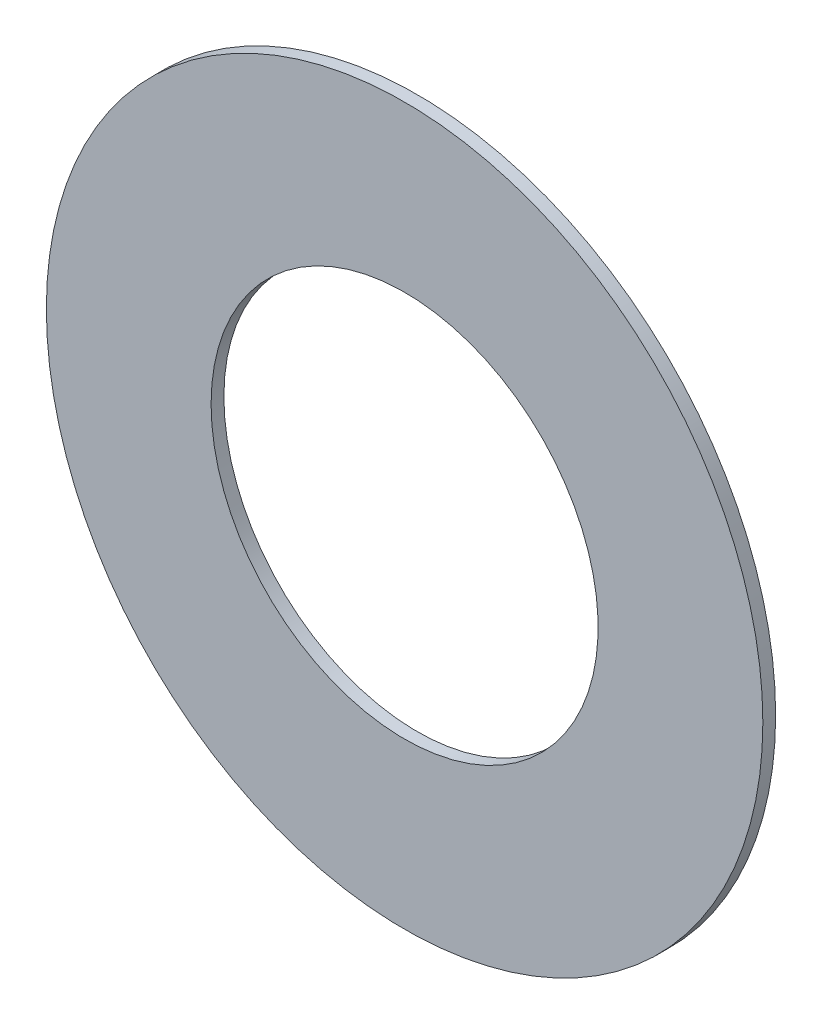
ISO-10303-21;
HEADER;
FILE_DESCRIPTION(('STEP AP214'),'2;1');
FILE_NAME('part.step','',(''),(''),'','','');
FILE_SCHEMA(('AUTOMOTIVE_DESIGN { 1 0 10303 214 1 1 1 1 }'));
ENDSEC;
DATA;
#1=APPLICATION_CONTEXT('core data for automotive mechanical design processes');
#2=APPLICATION_PROTOCOL_DEFINITION('international standard','automotive_design',2000,#1);
#3=PRODUCT_CONTEXT('',#1,'mechanical');
#4=PRODUCT('Part','Part','',(#3));
#5=PRODUCT_RELATED_PRODUCT_CATEGORY('part','',(#4));
#6=PRODUCT_DEFINITION_FORMATION('','',#4);
#7=PRODUCT_DEFINITION_CONTEXT('part definition',#1,'design');
#8=PRODUCT_DEFINITION('design','',#6,#7);
#9=PRODUCT_DEFINITION_SHAPE('','',#8);
#10=(LENGTH_UNIT() NAMED_UNIT(*) SI_UNIT(.MILLI.,.METRE.));
#11=(NAMED_UNIT(*) PLANE_ANGLE_UNIT() SI_UNIT($,.RADIAN.));
#12=(NAMED_UNIT(*) SI_UNIT($,.STERADIAN.) SOLID_ANGLE_UNIT());
#13=UNCERTAINTY_MEASURE_WITH_UNIT(LENGTH_MEASURE(1.E-05),#10,'distance_accuracy_value','');
#14=(GEOMETRIC_REPRESENTATION_CONTEXT(3) GLOBAL_UNCERTAINTY_ASSIGNED_CONTEXT((#13)) GLOBAL_UNIT_ASSIGNED_CONTEXT((#10,
#11,#12)) REPRESENTATION_CONTEXT('',''));
#15=CARTESIAN_POINT('',(0.,0.,0.));
#16=DIRECTION('',(0.,0.,1.));
#17=DIRECTION('',(1.,0.,0.));
#18=AXIS2_PLACEMENT_3D('',#15,#16,#17);
#19=CARTESIAN_POINT('',(0.,0.,0.));
#20=DIRECTION('',(0.,0.,1.));
#21=DIRECTION('',(1.,0.,0.));
#22=AXIS2_PLACEMENT_3D('',#19,#20,#21);
#23=PLANE('',#22);
#24=CARTESIAN_POINT('',(0.,0.,0.));
#25=DIRECTION('',(0.,0.,-1.));
#26=DIRECTION('',(-1.,0.,0.));
#27=AXIS2_PLACEMENT_3D('',#24,#25,#26);
#28=CIRCLE('',#27,7.6835);
#29=CARTESIAN_POINT('',(-7.6835,0.,0.));
#30=VERTEX_POINT('',#29);
#31=EDGE_CURVE('E26',#30,#30,#28,.F.);
#32=ORIENTED_EDGE('',*,*,#31,.T.);
#33=EDGE_LOOP('',(#32));
#34=FACE_BOUND('',#33,.T.);
#35=CARTESIAN_POINT('',(0.,0.,0.));
#36=DIRECTION('',(0.,0.,-1.));
#37=DIRECTION('',(-1.,0.,0.));
#38=AXIS2_PLACEMENT_3D('',#35,#36,#37);
#39=CIRCLE('',#38,14.224);
#40=CARTESIAN_POINT('',(-14.224,0.,0.));
#41=VERTEX_POINT('',#40);
#42=EDGE_CURVE('E17',#41,#41,#39,.F.);
#43=ORIENTED_EDGE('',*,*,#42,.F.);
#44=EDGE_LOOP('',(#43));
#45=FACE_BOUND('',#44,.T.);
#46=ADVANCED_FACE('F14',(#34,#45),#23,.F.);
#47=CARTESIAN_POINT('',(0.,0.,0.508));
#48=DIRECTION('',(0.,0.,-1.));
#49=DIRECTION('',(-1.,0.,0.));
#50=AXIS2_PLACEMENT_3D('',#47,#48,#49);
#51=CYLINDRICAL_SURFACE('',#50,14.224);
#52=ORIENTED_EDGE('',*,*,#42,.T.);
#53=EDGE_LOOP('',(#52));
#54=FACE_BOUND('',#53,.T.);
#55=CARTESIAN_POINT('',(0.,0.,0.508));
#56=DIRECTION('',(0.,0.,-1.));
#57=DIRECTION('',(-1.,0.,0.));
#58=AXIS2_PLACEMENT_3D('',#55,#56,#57);
#59=CIRCLE('',#58,14.224);
#60=CARTESIAN_POINT('',(-14.224,0.,0.508));
#61=VERTEX_POINT('',#60);
#62=EDGE_CURVE('E21',#61,#61,#59,.F.);
#63=ORIENTED_EDGE('',*,*,#62,.F.);
#64=EDGE_LOOP('',(#63));
#65=FACE_BOUND('',#64,.T.);
#66=ADVANCED_FACE('F34',(#54,#65),#51,.T.);
#67=CARTESIAN_POINT('',(0.,0.,0.508));
#68=DIRECTION('',(0.,0.,-1.));
#69=DIRECTION('',(-1.,0.,0.));
#70=AXIS2_PLACEMENT_3D('',#67,#68,#69);
#71=CYLINDRICAL_SURFACE('',#70,7.6835);
#72=CARTESIAN_POINT('',(0.,0.,0.508));
#73=DIRECTION('',(0.,0.,-1.));
#74=DIRECTION('',(-1.,0.,0.));
#75=AXIS2_PLACEMENT_3D('',#72,#73,#74);
#76=CIRCLE('',#75,7.6835);
#77=CARTESIAN_POINT('',(-7.6835,0.,0.508));
#78=VERTEX_POINT('',#77);
#79=EDGE_CURVE('E10',#78,#78,#76,.T.);
#80=ORIENTED_EDGE('',*,*,#79,.F.);
#81=EDGE_LOOP('',(#80));
#82=FACE_BOUND('',#81,.T.);
#83=ORIENTED_EDGE('',*,*,#31,.F.);
#84=EDGE_LOOP('',(#83));
#85=FACE_BOUND('',#84,.T.);
#86=ADVANCED_FACE('F42',(#82,#85),#71,.F.);
#87=CARTESIAN_POINT('',(0.,0.,0.508));
#88=DIRECTION('',(0.,0.,1.));
#89=DIRECTION('',(1.,0.,0.));
#90=AXIS2_PLACEMENT_3D('',#87,#88,#89);
#91=PLANE('',#90);
#92=ORIENTED_EDGE('',*,*,#79,.T.);
#93=EDGE_LOOP('',(#92));
#94=FACE_BOUND('',#93,.T.);
#95=ORIENTED_EDGE('',*,*,#62,.T.);
#96=EDGE_LOOP('',(#95));
#97=FACE_BOUND('',#96,.T.);
#98=ADVANCED_FACE('F43',(#94,#97),#91,.T.);
#99=CLOSED_SHELL('',(#46,#66,#86,#98));
#100=MANIFOLD_SOLID_BREP('B1',#99);
#101=ADVANCED_BREP_SHAPE_REPRESENTATION('',(#18,#100),#14);
#102=SHAPE_DEFINITION_REPRESENTATION(#9,#101);
ENDSEC;
END-ISO-10303-21;
